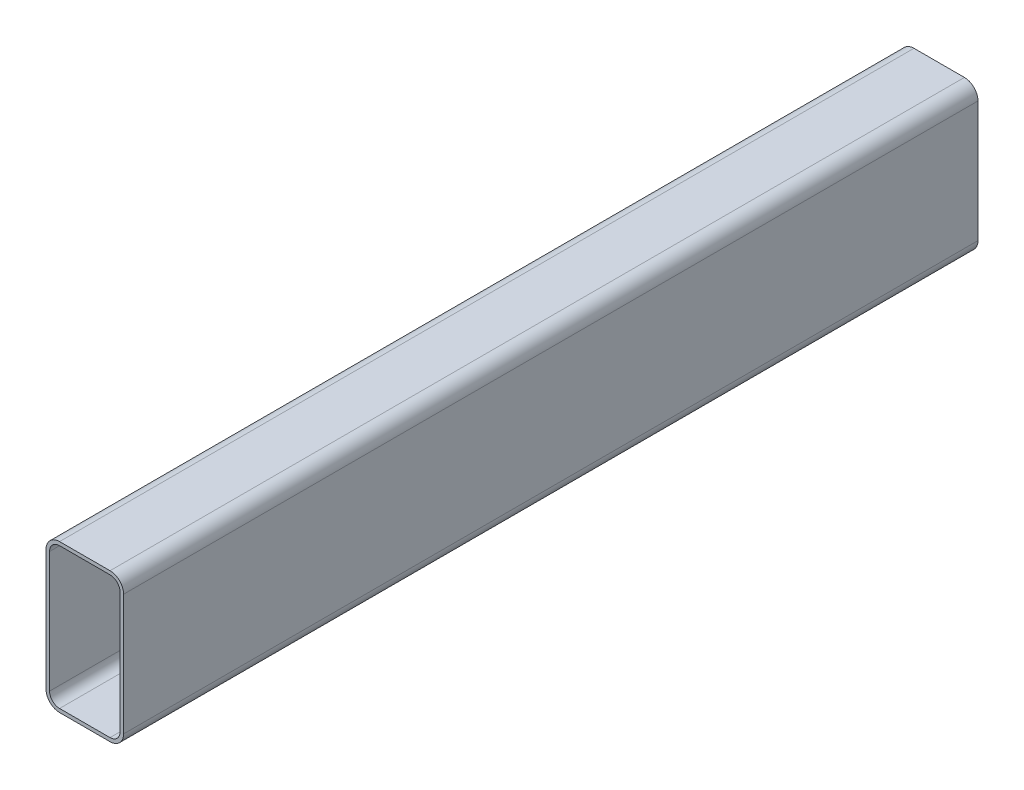
ISO-10303-21;
HEADER;
FILE_DESCRIPTION(('STEP AP214'),'2;1');
FILE_NAME('part.step','',(''),(''),'','','');
FILE_SCHEMA(('AUTOMOTIVE_DESIGN { 1 0 10303 214 1 1 1 1 }'));
ENDSEC;
DATA;
#1=APPLICATION_CONTEXT('core data for automotive mechanical design processes');
#2=APPLICATION_PROTOCOL_DEFINITION('international standard','automotive_design',2000,#1);
#3=PRODUCT_CONTEXT('',#1,'mechanical');
#4=PRODUCT('Part','Part','',(#3));
#5=PRODUCT_RELATED_PRODUCT_CATEGORY('part','',(#4));
#6=PRODUCT_DEFINITION_FORMATION('','',#4);
#7=PRODUCT_DEFINITION_CONTEXT('part definition',#1,'design');
#8=PRODUCT_DEFINITION('design','',#6,#7);
#9=PRODUCT_DEFINITION_SHAPE('','',#8);
#10=(LENGTH_UNIT() NAMED_UNIT(*) SI_UNIT(.MILLI.,.METRE.));
#11=(NAMED_UNIT(*) PLANE_ANGLE_UNIT() SI_UNIT($,.RADIAN.));
#12=(NAMED_UNIT(*) SI_UNIT($,.STERADIAN.) SOLID_ANGLE_UNIT());
#13=UNCERTAINTY_MEASURE_WITH_UNIT(LENGTH_MEASURE(1.E-05),#10,'distance_accuracy_value','');
#14=(GEOMETRIC_REPRESENTATION_CONTEXT(3) GLOBAL_UNCERTAINTY_ASSIGNED_CONTEXT((#13)) GLOBAL_UNIT_ASSIGNED_CONTEXT((#10,
#11,#12)) REPRESENTATION_CONTEXT('',''));
#15=CARTESIAN_POINT('',(0.,0.,0.));
#16=DIRECTION('',(0.,0.,1.));
#17=DIRECTION('',(1.,0.,0.));
#18=AXIS2_PLACEMENT_3D('',#15,#16,#17);
#19=CARTESIAN_POINT('',(9.001125,25.146,152.4));
#20=DIRECTION('',(0.,-1.,0.));
#21=DIRECTION('',(0.,0.,-1.));
#22=AXIS2_PLACEMENT_3D('',#19,#20,#21);
#23=PLANE('',#22);
#24=DIRECTION('',(-1.,0.,0.));
#25=VECTOR('',#24,1.);
#26=CARTESIAN_POINT('',(9.001125,25.146,-152.4));
#27=LINE('',#26,#25);
#28=CARTESIAN_POINT('',(9.001125,25.146,-152.4));
#29=VERTEX_POINT('',#28);
#30=CARTESIAN_POINT('',(-9.001125,25.146,-152.4));
#31=VERTEX_POINT('',#30);
#32=EDGE_CURVE('E197',#29,#31,#27,.T.);
#33=ORIENTED_EDGE('',*,*,#32,.F.);
#34=DIRECTION('',(0.,0.,-1.));
#35=VECTOR('',#34,1.);
#36=CARTESIAN_POINT('',(9.001125,25.146,152.4));
#37=LINE('',#36,#35);
#38=CARTESIAN_POINT('',(9.001125,25.146,152.4));
#39=VERTEX_POINT('',#38);
#40=EDGE_CURVE('E11',#39,#29,#37,.T.);
#41=ORIENTED_EDGE('',*,*,#40,.F.);
#42=DIRECTION('',(-1.,0.,0.));
#43=VECTOR('',#42,1.);
#44=CARTESIAN_POINT('',(9.001125,25.146,152.4));
#45=LINE('',#44,#43);
#46=CARTESIAN_POINT('',(-9.001125,25.146,152.4));
#47=VERTEX_POINT('',#46);
#48=EDGE_CURVE('E208',#39,#47,#45,.T.);
#49=ORIENTED_EDGE('',*,*,#48,.T.);
#50=DIRECTION('',(0.,0.,-1.));
#51=VECTOR('',#50,1.);
#52=CARTESIAN_POINT('',(-9.001125,25.146,152.4));
#53=LINE('',#52,#51);
#54=EDGE_CURVE('E241',#47,#31,#53,.T.);
#55=ORIENTED_EDGE('',*,*,#54,.T.);
#56=EDGE_LOOP('',(#33,#41,#49,#55));
#57=FACE_BOUND('',#56,.T.);
#58=ADVANCED_FACE('F16',(#57),#23,.T.);
#59=CARTESIAN_POINT('',(9.001125,21.574125,152.4));
#60=DIRECTION('',(0.,0.,-1.));
#61=DIRECTION('',(-1.,0.,0.));
#62=AXIS2_PLACEMENT_3D('',#59,#60,#61);
#63=CYLINDRICAL_SURFACE('',#62,3.571875);
#64=CARTESIAN_POINT('',(9.001125,21.574125,-152.4));
#65=DIRECTION('',(0.,0.,1.));
#66=DIRECTION('',(1.,0.,0.));
#67=AXIS2_PLACEMENT_3D('',#64,#65,#66);
#68=CIRCLE('',#67,3.571875);
#69=CARTESIAN_POINT('',(12.573,21.574125,-152.4));
#70=VERTEX_POINT('',#69);
#71=EDGE_CURVE('E201',#70,#29,#68,.T.);
#72=ORIENTED_EDGE('',*,*,#71,.F.);
#73=DIRECTION('',(0.,0.,-1.));
#74=VECTOR('',#73,1.);
#75=CARTESIAN_POINT('',(12.573,21.574125,152.4));
#76=LINE('',#75,#74);
#77=CARTESIAN_POINT('',(12.573,21.574125,152.4));
#78=VERTEX_POINT('',#77);
#79=EDGE_CURVE('E27',#78,#70,#76,.T.);
#80=ORIENTED_EDGE('',*,*,#79,.F.);
#81=CARTESIAN_POINT('',(9.001125,21.574125,152.4));
#82=DIRECTION('',(0.,0.,1.));
#83=DIRECTION('',(1.,0.,0.));
#84=AXIS2_PLACEMENT_3D('',#81,#82,#83);
#85=CIRCLE('',#84,3.571875);
#86=EDGE_CURVE('E212',#78,#39,#85,.T.);
#87=ORIENTED_EDGE('',*,*,#86,.T.);
#88=ORIENTED_EDGE('',*,*,#40,.T.);
#89=EDGE_LOOP('',(#72,#80,#87,#88));
#90=FACE_BOUND('',#89,.T.);
#91=ADVANCED_FACE('F412',(#90),#63,.F.);
#92=CARTESIAN_POINT('',(12.573,21.574125,152.4));
#93=DIRECTION('',(-1.,0.,0.));
#94=DIRECTION('',(0.,0.,1.));
#95=AXIS2_PLACEMENT_3D('',#92,#93,#94);
#96=PLANE('',#95);
#97=DIRECTION('',(0.,1.,0.));
#98=VECTOR('',#97,1.);
#99=CARTESIAN_POINT('',(12.573,21.574125,-152.4));
#100=LINE('',#99,#98);
#101=CARTESIAN_POINT('',(12.573,-21.574125,-152.4));
#102=VERTEX_POINT('',#101);
#103=EDGE_CURVE('E176',#102,#70,#100,.T.);
#104=ORIENTED_EDGE('',*,*,#103,.F.);
#105=DIRECTION('',(0.,0.,-1.));
#106=VECTOR('',#105,1.);
#107=CARTESIAN_POINT('',(12.573,-21.574125,152.4));
#108=LINE('',#107,#106);
#109=CARTESIAN_POINT('',(12.573,-21.574125,152.4));
#110=VERTEX_POINT('',#109);
#111=EDGE_CURVE('E141',#110,#102,#108,.T.);
#112=ORIENTED_EDGE('',*,*,#111,.F.);
#113=DIRECTION('',(0.,1.,0.));
#114=VECTOR('',#113,1.);
#115=CARTESIAN_POINT('',(12.573,21.574125,152.4));
#116=LINE('',#115,#114);
#117=EDGE_CURVE('E280',#110,#78,#116,.T.);
#118=ORIENTED_EDGE('',*,*,#117,.T.);
#119=ORIENTED_EDGE('',*,*,#79,.T.);
#120=EDGE_LOOP('',(#104,#112,#118,#119));
#121=FACE_BOUND('',#120,.T.);
#122=ADVANCED_FACE('F418',(#121),#96,.T.);
#123=CARTESIAN_POINT('',(9.001125,-21.574125,152.4));
#124=DIRECTION('',(0.,0.,-1.));
#125=DIRECTION('',(-1.,0.,0.));
#126=AXIS2_PLACEMENT_3D('',#123,#124,#125);
#127=CYLINDRICAL_SURFACE('',#126,3.571875);
#128=CARTESIAN_POINT('',(9.001125,-21.574125,-152.4));
#129=DIRECTION('',(0.,0.,1.));
#130=DIRECTION('',(1.,0.,0.));
#131=AXIS2_PLACEMENT_3D('',#128,#129,#130);
#132=CIRCLE('',#131,3.571875);
#133=CARTESIAN_POINT('',(9.001125,-25.146,-152.4));
#134=VERTEX_POINT('',#133);
#135=EDGE_CURVE('E171',#134,#102,#132,.T.);
#136=ORIENTED_EDGE('',*,*,#135,.F.);
#137=DIRECTION('',(0.,0.,-1.));
#138=VECTOR('',#137,1.);
#139=CARTESIAN_POINT('',(9.001125,-25.146,152.4));
#140=LINE('',#139,#138);
#141=CARTESIAN_POINT('',(9.001125,-25.146,152.4));
#142=VERTEX_POINT('',#141);
#143=EDGE_CURVE('E125',#142,#134,#140,.T.);
#144=ORIENTED_EDGE('',*,*,#143,.F.);
#145=CARTESIAN_POINT('',(9.001125,-21.574125,152.4));
#146=DIRECTION('',(0.,0.,1.));
#147=DIRECTION('',(1.,0.,0.));
#148=AXIS2_PLACEMENT_3D('',#145,#146,#147);
#149=CIRCLE('',#148,3.571875);
#150=EDGE_CURVE('E276',#142,#110,#149,.T.);
#151=ORIENTED_EDGE('',*,*,#150,.T.);
#152=ORIENTED_EDGE('',*,*,#111,.T.);
#153=EDGE_LOOP('',(#136,#144,#151,#152));
#154=FACE_BOUND('',#153,.T.);
#155=ADVANCED_FACE('F172',(#154),#127,.F.);
#156=CARTESIAN_POINT('',(-9.001125,-25.146,152.4));
#157=DIRECTION('',(0.,1.,0.));
#158=DIRECTION('',(1.,0.,0.));
#159=AXIS2_PLACEMENT_3D('',#156,#157,#158);
#160=PLANE('',#159);
#161=DIRECTION('',(1.,0.,0.));
#162=VECTOR('',#161,1.);
#163=CARTESIAN_POINT('',(-9.001125,-25.146,-152.4));
#164=LINE('',#163,#162);
#165=CARTESIAN_POINT('',(-9.001125,-25.146,-152.4));
#166=VERTEX_POINT('',#165);
#167=EDGE_CURVE('E162',#166,#134,#164,.T.);
#168=ORIENTED_EDGE('',*,*,#167,.F.);
#169=DIRECTION('',(0.,0.,-1.));
#170=VECTOR('',#169,1.);
#171=CARTESIAN_POINT('',(-9.001125,-25.146,152.4));
#172=LINE('',#171,#170);
#173=CARTESIAN_POINT('',(-9.001125,-25.146,152.4));
#174=VERTEX_POINT('',#173);
#175=EDGE_CURVE('E168',#174,#166,#172,.T.);
#176=ORIENTED_EDGE('',*,*,#175,.F.);
#177=DIRECTION('',(1.,0.,0.));
#178=VECTOR('',#177,1.);
#179=CARTESIAN_POINT('',(-9.001125,-25.146,152.4));
#180=LINE('',#179,#178);
#181=EDGE_CURVE('E165',#174,#142,#180,.T.);
#182=ORIENTED_EDGE('',*,*,#181,.T.);
#183=ORIENTED_EDGE('',*,*,#143,.T.);
#184=EDGE_LOOP('',(#168,#176,#182,#183));
#185=FACE_BOUND('',#184,.T.);
#186=ADVANCED_FACE('F160',(#185),#160,.T.);
#187=CARTESIAN_POINT('',(-9.001125,-21.574125,152.4));
#188=DIRECTION('',(0.,0.,-1.));
#189=DIRECTION('',(-1.,0.,0.));
#190=AXIS2_PLACEMENT_3D('',#187,#188,#189);
#191=CYLINDRICAL_SURFACE('',#190,3.571875);
#192=CARTESIAN_POINT('',(-9.001125,-21.574125,-152.4));
#193=DIRECTION('',(0.,0.,1.));
#194=DIRECTION('',(1.,0.,0.));
#195=AXIS2_PLACEMENT_3D('',#192,#193,#194);
#196=CIRCLE('',#195,3.571875);
#197=CARTESIAN_POINT('',(-12.573,-21.574125,-152.4));
#198=VERTEX_POINT('',#197);
#199=EDGE_CURVE('E183',#198,#166,#196,.T.);
#200=ORIENTED_EDGE('',*,*,#199,.F.);
#201=DIRECTION('',(0.,0.,-1.));
#202=VECTOR('',#201,1.);
#203=CARTESIAN_POINT('',(-12.573,-21.574125,152.4));
#204=LINE('',#203,#202);
#205=CARTESIAN_POINT('',(-12.573,-21.574125,152.4));
#206=VERTEX_POINT('',#205);
#207=EDGE_CURVE('E291',#206,#198,#204,.T.);
#208=ORIENTED_EDGE('',*,*,#207,.F.);
#209=CARTESIAN_POINT('',(-9.001125,-21.574125,152.4));
#210=DIRECTION('',(0.,0.,1.));
#211=DIRECTION('',(1.,0.,0.));
#212=AXIS2_PLACEMENT_3D('',#209,#210,#211);
#213=CIRCLE('',#212,3.571875);
#214=EDGE_CURVE('E256',#206,#174,#213,.T.);
#215=ORIENTED_EDGE('',*,*,#214,.T.);
#216=ORIENTED_EDGE('',*,*,#175,.T.);
#217=EDGE_LOOP('',(#200,#208,#215,#216));
#218=FACE_BOUND('',#217,.T.);
#219=ADVANCED_FACE('F399',(#218),#191,.F.);
#220=CARTESIAN_POINT('',(-12.573,-21.574125,152.4));
#221=DIRECTION('',(1.,0.,0.));
#222=DIRECTION('',(0.,1.,0.));
#223=AXIS2_PLACEMENT_3D('',#220,#221,#222);
#224=PLANE('',#223);
#225=DIRECTION('',(0.,-1.,0.));
#226=VECTOR('',#225,1.);
#227=CARTESIAN_POINT('',(-12.573,-21.574125,-152.4));
#228=LINE('',#227,#226);
#229=CARTESIAN_POINT('',(-12.573,21.574125,-152.4));
#230=VERTEX_POINT('',#229);
#231=EDGE_CURVE('E191',#230,#198,#228,.T.);
#232=ORIENTED_EDGE('',*,*,#231,.F.);
#233=DIRECTION('',(0.,0.,-1.));
#234=VECTOR('',#233,1.);
#235=CARTESIAN_POINT('',(-12.573,21.574125,152.4));
#236=LINE('',#235,#234);
#237=CARTESIAN_POINT('',(-12.573,21.574125,152.4));
#238=VERTEX_POINT('',#237);
#239=EDGE_CURVE('E244',#238,#230,#236,.T.);
#240=ORIENTED_EDGE('',*,*,#239,.F.);
#241=DIRECTION('',(0.,-1.,0.));
#242=VECTOR('',#241,1.);
#243=CARTESIAN_POINT('',(-12.573,-21.574125,152.4));
#244=LINE('',#243,#242);
#245=EDGE_CURVE('E206',#238,#206,#244,.T.);
#246=ORIENTED_EDGE('',*,*,#245,.T.);
#247=ORIENTED_EDGE('',*,*,#207,.T.);
#248=EDGE_LOOP('',(#232,#240,#246,#247));
#249=FACE_BOUND('',#248,.T.);
#250=ADVANCED_FACE('F397',(#249),#224,.T.);
#251=CARTESIAN_POINT('',(-9.001125,21.574125,152.4));
#252=DIRECTION('',(0.,0.,-1.));
#253=DIRECTION('',(-1.,0.,0.));
#254=AXIS2_PLACEMENT_3D('',#251,#252,#253);
#255=CYLINDRICAL_SURFACE('',#254,3.571875);
#256=CARTESIAN_POINT('',(-9.001125,21.574125,-152.4));
#257=DIRECTION('',(0.,0.,1.));
#258=DIRECTION('',(1.,0.,0.));
#259=AXIS2_PLACEMENT_3D('',#256,#257,#258);
#260=CIRCLE('',#259,3.571875);
#261=EDGE_CURVE('E218',#31,#230,#260,.T.);
#262=ORIENTED_EDGE('',*,*,#261,.F.);
#263=ORIENTED_EDGE('',*,*,#54,.F.);
#264=CARTESIAN_POINT('',(-9.001125,21.574125,152.4));
#265=DIRECTION('',(0.,0.,1.));
#266=DIRECTION('',(1.,0.,0.));
#267=AXIS2_PLACEMENT_3D('',#264,#265,#266);
#268=CIRCLE('',#267,3.571875);
#269=EDGE_CURVE('E213',#47,#238,#268,.T.);
#270=ORIENTED_EDGE('',*,*,#269,.T.);
#271=ORIENTED_EDGE('',*,*,#239,.T.);
#272=EDGE_LOOP('',(#262,#263,#270,#271));
#273=FACE_BOUND('',#272,.T.);
#274=ADVANCED_FACE('F18',(#273),#255,.F.);
#275=CARTESIAN_POINT('',(13.843,21.574125,152.4));
#276=DIRECTION('',(-1.,0.,0.));
#277=DIRECTION('',(0.,0.,1.));
#278=AXIS2_PLACEMENT_3D('',#275,#276,#277);
#279=PLANE('',#278);
#280=DIRECTION('',(0.,1.,0.));
#281=VECTOR('',#280,1.);
#282=CARTESIAN_POINT('',(13.843,21.574125,-152.4));
#283=LINE('',#282,#281);
#284=CARTESIAN_POINT('',(13.843,-21.574125,-152.4));
#285=VERTEX_POINT('',#284);
#286=CARTESIAN_POINT('',(13.843,21.574125,-152.4));
#287=VERTEX_POINT('',#286);
#288=EDGE_CURVE('E252',#285,#287,#283,.T.);
#289=ORIENTED_EDGE('',*,*,#288,.T.);
#290=DIRECTION('',(0.,0.,-1.));
#291=VECTOR('',#290,1.);
#292=CARTESIAN_POINT('',(13.843,21.574125,152.4));
#293=LINE('',#292,#291);
#294=CARTESIAN_POINT('',(13.843,21.574125,152.4));
#295=VERTEX_POINT('',#294);
#296=EDGE_CURVE('E236',#295,#287,#293,.T.);
#297=ORIENTED_EDGE('',*,*,#296,.F.);
#298=DIRECTION('',(0.,1.,0.));
#299=VECTOR('',#298,1.);
#300=CARTESIAN_POINT('',(13.843,21.574125,152.4));
#301=LINE('',#300,#299);
#302=CARTESIAN_POINT('',(13.843,-21.574125,152.4));
#303=VERTEX_POINT('',#302);
#304=EDGE_CURVE('E202',#303,#295,#301,.T.);
#305=ORIENTED_EDGE('',*,*,#304,.F.);
#306=DIRECTION('',(0.,0.,-1.));
#307=VECTOR('',#306,1.);
#308=CARTESIAN_POINT('',(13.843,-21.574125,152.4));
#309=LINE('',#308,#307);
#310=EDGE_CURVE('E195',#303,#285,#309,.T.);
#311=ORIENTED_EDGE('',*,*,#310,.T.);
#312=EDGE_LOOP('',(#289,#297,#305,#311));
#313=FACE_BOUND('',#312,.T.);
#314=ADVANCED_FACE('F433',(#313),#279,.F.);
#315=CARTESIAN_POINT('',(9.001125,-21.574125,152.4));
#316=DIRECTION('',(0.,0.,-1.));
#317=DIRECTION('',(-1.,0.,0.));
#318=AXIS2_PLACEMENT_3D('',#315,#316,#317);
#319=CYLINDRICAL_SURFACE('',#318,4.841875);
#320=CARTESIAN_POINT('',(9.001125,-21.574125,-152.4));
#321=DIRECTION('',(0.,0.,1.));
#322=DIRECTION('',(1.,0.,0.));
#323=AXIS2_PLACEMENT_3D('',#320,#321,#322);
#324=CIRCLE('',#323,4.841875);
#325=CARTESIAN_POINT('',(9.001125,-26.416,-152.4));
#326=VERTEX_POINT('',#325);
#327=EDGE_CURVE('E248',#326,#285,#324,.T.);
#328=ORIENTED_EDGE('',*,*,#327,.T.);
#329=ORIENTED_EDGE('',*,*,#310,.F.);
#330=CARTESIAN_POINT('',(9.001125,-21.574125,152.4));
#331=DIRECTION('',(0.,0.,1.));
#332=DIRECTION('',(1.,0.,0.));
#333=AXIS2_PLACEMENT_3D('',#330,#331,#332);
#334=CIRCLE('',#333,4.841875);
#335=CARTESIAN_POINT('',(9.001125,-26.416,152.4));
#336=VERTEX_POINT('',#335);
#337=EDGE_CURVE('E207',#336,#303,#334,.T.);
#338=ORIENTED_EDGE('',*,*,#337,.F.);
#339=DIRECTION('',(0.,0.,-1.));
#340=VECTOR('',#339,1.);
#341=CARTESIAN_POINT('',(9.001125,-26.416,152.4));
#342=LINE('',#341,#340);
#343=EDGE_CURVE('E237',#336,#326,#342,.T.);
#344=ORIENTED_EDGE('',*,*,#343,.T.);
#345=EDGE_LOOP('',(#328,#329,#338,#344));
#346=FACE_BOUND('',#345,.T.);
#347=ADVANCED_FACE('F342',(#346),#319,.T.);
#348=CARTESIAN_POINT('',(-9.001125,-26.416,152.4));
#349=DIRECTION('',(0.,1.,0.));
#350=DIRECTION('',(1.,0.,0.));
#351=AXIS2_PLACEMENT_3D('',#348,#349,#350);
#352=PLANE('',#351);
#353=DIRECTION('',(1.,0.,0.));
#354=VECTOR('',#353,1.);
#355=CARTESIAN_POINT('',(-9.001125,-26.416,-152.4));
#356=LINE('',#355,#354);
#357=CARTESIAN_POINT('',(-9.001125,-26.416,-152.4));
#358=VERTEX_POINT('',#357);
#359=EDGE_CURVE('E251',#358,#326,#356,.T.);
#360=ORIENTED_EDGE('',*,*,#359,.T.);
#361=ORIENTED_EDGE('',*,*,#343,.F.);
#362=DIRECTION('',(1.,0.,0.));
#363=VECTOR('',#362,1.);
#364=CARTESIAN_POINT('',(-9.001125,-26.416,152.4));
#365=LINE('',#364,#363);
#366=CARTESIAN_POINT('',(-9.001125,-26.416,152.4));
#367=VERTEX_POINT('',#366);
#368=EDGE_CURVE('E309',#367,#336,#365,.T.);
#369=ORIENTED_EDGE('',*,*,#368,.F.);
#370=DIRECTION('',(0.,0.,-1.));
#371=VECTOR('',#370,1.);
#372=CARTESIAN_POINT('',(-9.001125,-26.416,152.4));
#373=LINE('',#372,#371);
#374=EDGE_CURVE('E231',#367,#358,#373,.T.);
#375=ORIENTED_EDGE('',*,*,#374,.T.);
#376=EDGE_LOOP('',(#360,#361,#369,#375));
#377=FACE_BOUND('',#376,.T.);
#378=ADVANCED_FACE('F328',(#377),#352,.F.);
#379=CARTESIAN_POINT('',(-9.001125,-21.574125,152.4));
#380=DIRECTION('',(0.,0.,-1.));
#381=DIRECTION('',(-1.,0.,0.));
#382=AXIS2_PLACEMENT_3D('',#379,#380,#381);
#383=CYLINDRICAL_SURFACE('',#382,4.841875);
#384=CARTESIAN_POINT('',(-9.001125,-21.574125,-152.4));
#385=DIRECTION('',(0.,0.,1.));
#386=DIRECTION('',(1.,0.,0.));
#387=AXIS2_PLACEMENT_3D('',#384,#385,#386);
#388=CIRCLE('',#387,4.841875);
#389=CARTESIAN_POINT('',(-13.843,-21.574125,-152.4));
#390=VERTEX_POINT('',#389);
#391=EDGE_CURVE('E284',#390,#358,#388,.T.);
#392=ORIENTED_EDGE('',*,*,#391,.T.);
#393=ORIENTED_EDGE('',*,*,#374,.F.);
#394=CARTESIAN_POINT('',(-9.001125,-21.574125,152.4));
#395=DIRECTION('',(0.,0.,1.));
#396=DIRECTION('',(1.,0.,0.));
#397=AXIS2_PLACEMENT_3D('',#394,#395,#396);
#398=CIRCLE('',#397,4.841875);
#399=CARTESIAN_POINT('',(-13.843,-21.574125,152.4));
#400=VERTEX_POINT('',#399);
#401=EDGE_CURVE('E226',#400,#367,#398,.T.);
#402=ORIENTED_EDGE('',*,*,#401,.F.);
#403=DIRECTION('',(0.,0.,-1.));
#404=VECTOR('',#403,1.);
#405=CARTESIAN_POINT('',(-13.843,-21.574125,152.4));
#406=LINE('',#405,#404);
#407=EDGE_CURVE('E228',#400,#390,#406,.T.);
#408=ORIENTED_EDGE('',*,*,#407,.T.);
#409=EDGE_LOOP('',(#392,#393,#402,#408));
#410=FACE_BOUND('',#409,.T.);
#411=ADVANCED_FACE('F336',(#410),#383,.T.);
#412=CARTESIAN_POINT('',(-13.843,-21.574125,152.4));
#413=DIRECTION('',(1.,0.,0.));
#414=DIRECTION('',(0.,1.,0.));
#415=AXIS2_PLACEMENT_3D('',#412,#413,#414);
#416=PLANE('',#415);
#417=DIRECTION('',(0.,-1.,0.));
#418=VECTOR('',#417,1.);
#419=CARTESIAN_POINT('',(-13.843,-21.574125,-152.4));
#420=LINE('',#419,#418);
#421=CARTESIAN_POINT('',(-13.843,21.574125,-152.4));
#422=VERTEX_POINT('',#421);
#423=EDGE_CURVE('E281',#422,#390,#420,.T.);
#424=ORIENTED_EDGE('',*,*,#423,.T.);
#425=ORIENTED_EDGE('',*,*,#407,.F.);
#426=DIRECTION('',(0.,-1.,0.));
#427=VECTOR('',#426,1.);
#428=CARTESIAN_POINT('',(-13.843,-21.574125,152.4));
#429=LINE('',#428,#427);
#430=CARTESIAN_POINT('',(-13.843,21.574125,152.4));
#431=VERTEX_POINT('',#430);
#432=EDGE_CURVE('E222',#431,#400,#429,.T.);
#433=ORIENTED_EDGE('',*,*,#432,.F.);
#434=DIRECTION('',(0.,0.,-1.));
#435=VECTOR('',#434,1.);
#436=CARTESIAN_POINT('',(-13.843,21.574125,152.4));
#437=LINE('',#436,#435);
#438=EDGE_CURVE('E232',#431,#422,#437,.T.);
#439=ORIENTED_EDGE('',*,*,#438,.T.);
#440=EDGE_LOOP('',(#424,#425,#433,#439));
#441=FACE_BOUND('',#440,.T.);
#442=ADVANCED_FACE('F426',(#441),#416,.F.);
#443=CARTESIAN_POINT('',(-9.001125,21.574125,152.4));
#444=DIRECTION('',(0.,0.,-1.));
#445=DIRECTION('',(-1.,0.,0.));
#446=AXIS2_PLACEMENT_3D('',#443,#444,#445);
#447=CYLINDRICAL_SURFACE('',#446,4.841875);
#448=CARTESIAN_POINT('',(-9.001125,21.574125,-152.4));
#449=DIRECTION('',(0.,0.,1.));
#450=DIRECTION('',(1.,0.,0.));
#451=AXIS2_PLACEMENT_3D('',#448,#449,#450);
#452=CIRCLE('',#451,4.841875);
#453=CARTESIAN_POINT('',(-9.001125,26.416,-152.4));
#454=VERTEX_POINT('',#453);
#455=EDGE_CURVE('E219',#454,#422,#452,.T.);
#456=ORIENTED_EDGE('',*,*,#455,.T.);
#457=ORIENTED_EDGE('',*,*,#438,.F.);
#458=CARTESIAN_POINT('',(-9.001125,21.574125,152.4));
#459=DIRECTION('',(0.,0.,1.));
#460=DIRECTION('',(1.,0.,0.));
#461=AXIS2_PLACEMENT_3D('',#458,#459,#460);
#462=CIRCLE('',#461,4.841875);
#463=CARTESIAN_POINT('',(-9.001125,26.416,152.4));
#464=VERTEX_POINT('',#463);
#465=EDGE_CURVE('E227',#464,#431,#462,.T.);
#466=ORIENTED_EDGE('',*,*,#465,.F.);
#467=DIRECTION('',(0.,0.,-1.));
#468=VECTOR('',#467,1.);
#469=CARTESIAN_POINT('',(-9.001125,26.416,152.4));
#470=LINE('',#469,#468);
#471=EDGE_CURVE('E305',#464,#454,#470,.T.);
#472=ORIENTED_EDGE('',*,*,#471,.T.);
#473=EDGE_LOOP('',(#456,#457,#466,#472));
#474=FACE_BOUND('',#473,.T.);
#475=ADVANCED_FACE('F423',(#474),#447,.T.);
#476=CARTESIAN_POINT('',(9.001125,26.416,152.4));
#477=DIRECTION('',(0.,-1.,0.));
#478=DIRECTION('',(0.,0.,-1.));
#479=AXIS2_PLACEMENT_3D('',#476,#477,#478);
#480=PLANE('',#479);
#481=DIRECTION('',(-1.,0.,0.));
#482=VECTOR('',#481,1.);
#483=CARTESIAN_POINT('',(9.001125,26.416,-152.4));
#484=LINE('',#483,#482);
#485=CARTESIAN_POINT('',(9.001125,26.416,-152.4));
#486=VERTEX_POINT('',#485);
#487=EDGE_CURVE('E214',#486,#454,#484,.T.);
#488=ORIENTED_EDGE('',*,*,#487,.T.);
#489=ORIENTED_EDGE('',*,*,#471,.F.);
#490=DIRECTION('',(-1.,0.,0.));
#491=VECTOR('',#490,1.);
#492=CARTESIAN_POINT('',(9.001125,26.416,152.4));
#493=LINE('',#492,#491);
#494=CARTESIAN_POINT('',(9.001125,26.416,152.4));
#495=VERTEX_POINT('',#494);
#496=EDGE_CURVE('E20',#495,#464,#493,.T.);
#497=ORIENTED_EDGE('',*,*,#496,.F.);
#498=DIRECTION('',(0.,0.,-1.));
#499=VECTOR('',#498,1.);
#500=CARTESIAN_POINT('',(9.001125,26.416,152.4));
#501=LINE('',#500,#499);
#502=EDGE_CURVE('E200',#495,#486,#501,.T.);
#503=ORIENTED_EDGE('',*,*,#502,.T.);
#504=EDGE_LOOP('',(#488,#489,#497,#503));
#505=FACE_BOUND('',#504,.T.);
#506=ADVANCED_FACE('F372',(#505),#480,.F.);
#507=CARTESIAN_POINT('',(9.001125,21.574125,152.4));
#508=DIRECTION('',(0.,0.,-1.));
#509=DIRECTION('',(-1.,0.,0.));
#510=AXIS2_PLACEMENT_3D('',#507,#508,#509);
#511=CYLINDRICAL_SURFACE('',#510,4.841875);
#512=CARTESIAN_POINT('',(9.001125,21.574125,-152.4));
#513=DIRECTION('',(0.,0.,1.));
#514=DIRECTION('',(1.,0.,0.));
#515=AXIS2_PLACEMENT_3D('',#512,#513,#514);
#516=CIRCLE('',#515,4.841875);
#517=EDGE_CURVE('E253',#287,#486,#516,.T.);
#518=ORIENTED_EDGE('',*,*,#517,.T.);
#519=ORIENTED_EDGE('',*,*,#502,.F.);
#520=CARTESIAN_POINT('',(9.001125,21.574125,152.4));
#521=DIRECTION('',(0.,0.,1.));
#522=DIRECTION('',(1.,0.,0.));
#523=AXIS2_PLACEMENT_3D('',#520,#521,#522);
#524=CIRCLE('',#523,4.841875);
#525=EDGE_CURVE('E369',#295,#495,#524,.T.);
#526=ORIENTED_EDGE('',*,*,#525,.F.);
#527=ORIENTED_EDGE('',*,*,#296,.T.);
#528=EDGE_LOOP('',(#518,#519,#526,#527));
#529=FACE_BOUND('',#528,.T.);
#530=ADVANCED_FACE('F367',(#529),#511,.T.);
#531=CARTESIAN_POINT('',(9.001125,21.574125,-152.4));
#532=DIRECTION('',(0.,0.,1.));
#533=DIRECTION('',(1.,0.,0.));
#534=AXIS2_PLACEMENT_3D('',#531,#532,#533);
#535=PLANE('',#534);
#536=ORIENTED_EDGE('',*,*,#261,.T.);
#537=ORIENTED_EDGE('',*,*,#231,.T.);
#538=ORIENTED_EDGE('',*,*,#199,.T.);
#539=ORIENTED_EDGE('',*,*,#167,.T.);
#540=ORIENTED_EDGE('',*,*,#135,.T.);
#541=ORIENTED_EDGE('',*,*,#103,.T.);
#542=ORIENTED_EDGE('',*,*,#71,.T.);
#543=ORIENTED_EDGE('',*,*,#32,.T.);
#544=EDGE_LOOP('',(#536,#537,#538,#539,#540,#541,#542,#543));
#545=FACE_BOUND('',#544,.T.);
#546=ORIENTED_EDGE('',*,*,#517,.F.);
#547=ORIENTED_EDGE('',*,*,#288,.F.);
#548=ORIENTED_EDGE('',*,*,#327,.F.);
#549=ORIENTED_EDGE('',*,*,#359,.F.);
#550=ORIENTED_EDGE('',*,*,#391,.F.);
#551=ORIENTED_EDGE('',*,*,#423,.F.);
#552=ORIENTED_EDGE('',*,*,#455,.F.);
#553=ORIENTED_EDGE('',*,*,#487,.F.);
#554=EDGE_LOOP('',(#546,#547,#548,#549,#550,#551,#552,#553));
#555=FACE_BOUND('',#554,.T.);
#556=ADVANCED_FACE('F179',(#545,#555),#535,.F.);
#557=CARTESIAN_POINT('',(9.001125,21.574125,152.4));
#558=DIRECTION('',(0.,0.,1.));
#559=DIRECTION('',(1.,0.,0.));
#560=AXIS2_PLACEMENT_3D('',#557,#558,#559);
#561=PLANE('',#560);
#562=ORIENTED_EDGE('',*,*,#245,.F.);
#563=ORIENTED_EDGE('',*,*,#269,.F.);
#564=ORIENTED_EDGE('',*,*,#48,.F.);
#565=ORIENTED_EDGE('',*,*,#86,.F.);
#566=ORIENTED_EDGE('',*,*,#117,.F.);
#567=ORIENTED_EDGE('',*,*,#150,.F.);
#568=ORIENTED_EDGE('',*,*,#181,.F.);
#569=ORIENTED_EDGE('',*,*,#214,.F.);
#570=EDGE_LOOP('',(#562,#563,#564,#565,#566,#567,#568,#569));
#571=FACE_BOUND('',#570,.T.);
#572=ORIENTED_EDGE('',*,*,#525,.T.);
#573=ORIENTED_EDGE('',*,*,#496,.T.);
#574=ORIENTED_EDGE('',*,*,#465,.T.);
#575=ORIENTED_EDGE('',*,*,#432,.T.);
#576=ORIENTED_EDGE('',*,*,#401,.T.);
#577=ORIENTED_EDGE('',*,*,#368,.T.);
#578=ORIENTED_EDGE('',*,*,#337,.T.);
#579=ORIENTED_EDGE('',*,*,#304,.T.);
#580=EDGE_LOOP('',(#572,#573,#574,#575,#576,#577,#578,#579));
#581=FACE_BOUND('',#580,.T.);
#582=ADVANCED_FACE('F375',(#571,#581),#561,.T.);
#583=CLOSED_SHELL('',(#58,#91,#122,#155,#186,#219,#250,#274,#314,#347,#378,#411,#442,#475,#506,
#530,#556,#582));
#584=MANIFOLD_SOLID_BREP('B1',#583);
#585=ADVANCED_BREP_SHAPE_REPRESENTATION('',(#18,#584),#14);
#586=SHAPE_DEFINITION_REPRESENTATION(#9,#585);
ENDSEC;
END-ISO-10303-21;
